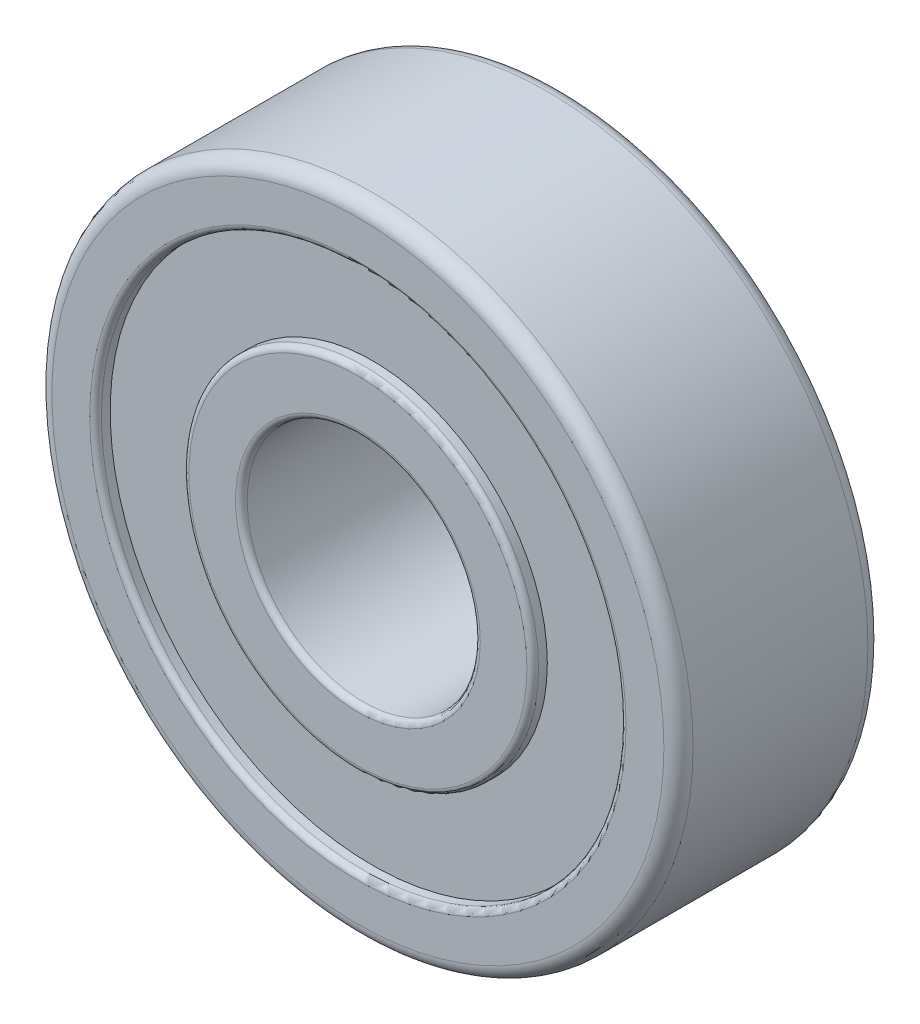
ISO-10303-21;
HEADER;
FILE_DESCRIPTION(('STEP AP214'),'2;1');
FILE_NAME('part.step','',(''),(''),'','','');
FILE_SCHEMA(('AUTOMOTIVE_DESIGN { 1 0 10303 214 1 1 1 1 }'));
ENDSEC;
DATA;
#1=APPLICATION_CONTEXT('core data for automotive mechanical design processes');
#2=APPLICATION_PROTOCOL_DEFINITION('international standard','automotive_design',2000,#1);
#3=PRODUCT_CONTEXT('',#1,'mechanical');
#4=PRODUCT('Part','Part','',(#3));
#5=PRODUCT_RELATED_PRODUCT_CATEGORY('part','',(#4));
#6=PRODUCT_DEFINITION_FORMATION('','',#4);
#7=PRODUCT_DEFINITION_CONTEXT('part definition',#1,'design');
#8=PRODUCT_DEFINITION('design','',#6,#7);
#9=PRODUCT_DEFINITION_SHAPE('','',#8);
#10=(LENGTH_UNIT() NAMED_UNIT(*) SI_UNIT(.MILLI.,.METRE.));
#11=(NAMED_UNIT(*) PLANE_ANGLE_UNIT() SI_UNIT($,.RADIAN.));
#12=(NAMED_UNIT(*) SI_UNIT($,.STERADIAN.) SOLID_ANGLE_UNIT());
#13=UNCERTAINTY_MEASURE_WITH_UNIT(LENGTH_MEASURE(1.E-05),#10,'distance_accuracy_value','');
#14=(GEOMETRIC_REPRESENTATION_CONTEXT(3) GLOBAL_UNCERTAINTY_ASSIGNED_CONTEXT((#13)) GLOBAL_UNIT_ASSIGNED_CONTEXT((#10,
#11,#12)) REPRESENTATION_CONTEXT('',''));
#15=CARTESIAN_POINT('',(0.,0.,0.));
#16=DIRECTION('',(0.,0.,1.));
#17=DIRECTION('',(1.,0.,0.));
#18=AXIS2_PLACEMENT_3D('',#15,#16,#17);
#19=CARTESIAN_POINT('',(0.,0.,7.));
#20=DIRECTION('',(0.,0.,1.));
#21=DIRECTION('',(1.,0.,0.));
#22=AXIS2_PLACEMENT_3D('',#19,#20,#21);
#23=PLANE('',#22);
#24=CARTESIAN_POINT('',(0.,0.,7.));
#25=DIRECTION('',(0.,0.,1.));
#26=DIRECTION('',(1.,0.,0.));
#27=AXIS2_PLACEMENT_3D('',#24,#25,#26);
#28=CIRCLE('',#27,4.2);
#29=CARTESIAN_POINT('',(4.2,0.,7.));
#30=VERTEX_POINT('',#29);
#31=EDGE_CURVE('E65',#30,#30,#28,.F.);
#32=ORIENTED_EDGE('',*,*,#31,.T.);
#33=EDGE_LOOP('',(#32));
#34=FACE_BOUND('',#33,.T.);
#35=CARTESIAN_POINT('',(0.,0.,7.));
#36=DIRECTION('',(0.,0.,1.));
#37=DIRECTION('',(1.,0.,0.));
#38=AXIS2_PLACEMENT_3D('',#35,#36,#37);
#39=CIRCLE('',#38,5.8);
#40=CARTESIAN_POINT('',(5.8,0.,7.));
#41=VERTEX_POINT('',#40);
#42=EDGE_CURVE('E68',#41,#41,#39,.T.);
#43=ORIENTED_EDGE('',*,*,#42,.T.);
#44=EDGE_LOOP('',(#43));
#45=FACE_BOUND('',#44,.T.);
#46=ADVANCED_FACE('F33',(#34,#45),#23,.T.);
#47=CARTESIAN_POINT('',(0.,0.,0.));
#48=DIRECTION('',(0.,0.,1.));
#49=DIRECTION('',(1.,0.,0.));
#50=AXIS2_PLACEMENT_3D('',#47,#48,#49);
#51=PLANE('',#50);
#52=CARTESIAN_POINT('',(0.,0.,0.));
#53=DIRECTION('',(0.,0.,1.));
#54=DIRECTION('',(1.,0.,0.));
#55=AXIS2_PLACEMENT_3D('',#52,#53,#54);
#56=CIRCLE('',#55,4.2);
#57=CARTESIAN_POINT('',(4.2,0.,0.));
#58=VERTEX_POINT('',#57);
#59=EDGE_CURVE('E59',#58,#58,#56,.T.);
#60=ORIENTED_EDGE('',*,*,#59,.T.);
#61=EDGE_LOOP('',(#60));
#62=FACE_BOUND('',#61,.T.);
#63=CARTESIAN_POINT('',(0.,0.,0.));
#64=DIRECTION('',(0.,0.,1.));
#65=DIRECTION('',(1.,0.,0.));
#66=AXIS2_PLACEMENT_3D('',#63,#64,#65);
#67=CIRCLE('',#66,5.8);
#68=CARTESIAN_POINT('',(5.8,0.,0.));
#69=VERTEX_POINT('',#68);
#70=EDGE_CURVE('E62',#69,#69,#67,.F.);
#71=ORIENTED_EDGE('',*,*,#70,.T.);
#72=EDGE_LOOP('',(#71));
#73=FACE_BOUND('',#72,.T.);
#74=ADVANCED_FACE('F122',(#62,#73),#51,.F.);
#75=CARTESIAN_POINT('',(0.,0.,7.));
#76=DIRECTION('',(0.,0.,1.));
#77=DIRECTION('',(1.,0.,0.));
#78=AXIS2_PLACEMENT_3D('',#75,#76,#77);
#79=CIRCLE('',#78,9.2);
#80=CARTESIAN_POINT('',(9.2,0.,7.));
#81=VERTEX_POINT('',#80);
#82=EDGE_CURVE('E48',#81,#81,#79,.F.);
#83=ORIENTED_EDGE('',*,*,#82,.T.);
#84=EDGE_LOOP('',(#83));
#85=FACE_BOUND('',#84,.T.);
#86=CARTESIAN_POINT('',(0.,0.,7.));
#87=DIRECTION('',(0.,0.,1.));
#88=DIRECTION('',(1.,0.,0.));
#89=AXIS2_PLACEMENT_3D('',#86,#87,#88);
#90=CIRCLE('',#89,10.5);
#91=CARTESIAN_POINT('',(10.5,0.,7.));
#92=VERTEX_POINT('',#91);
#93=EDGE_CURVE('E86',#92,#92,#90,.T.);
#94=ORIENTED_EDGE('',*,*,#93,.T.);
#95=EDGE_LOOP('',(#94));
#96=FACE_BOUND('',#95,.T.);
#97=ADVANCED_FACE('F125',(#85,#96),#23,.T.);
#98=CARTESIAN_POINT('',(0.,0.,0.));
#99=DIRECTION('',(0.,0.,1.));
#100=DIRECTION('',(1.,0.,0.));
#101=AXIS2_PLACEMENT_3D('',#98,#99,#100);
#102=CIRCLE('',#101,9.2);
#103=CARTESIAN_POINT('',(9.2,0.,0.));
#104=VERTEX_POINT('',#103);
#105=EDGE_CURVE('E10',#104,#104,#102,.T.);
#106=ORIENTED_EDGE('',*,*,#105,.T.);
#107=EDGE_LOOP('',(#106));
#108=FACE_BOUND('',#107,.T.);
#109=CARTESIAN_POINT('',(0.,0.,0.));
#110=DIRECTION('',(0.,0.,1.));
#111=DIRECTION('',(1.,0.,0.));
#112=AXIS2_PLACEMENT_3D('',#109,#110,#111);
#113=CIRCLE('',#112,10.5);
#114=CARTESIAN_POINT('',(10.5,0.,0.));
#115=VERTEX_POINT('',#114);
#116=EDGE_CURVE('E77',#115,#115,#113,.F.);
#117=ORIENTED_EDGE('',*,*,#116,.T.);
#118=EDGE_LOOP('',(#117));
#119=FACE_BOUND('',#118,.T.);
#120=ADVANCED_FACE('F131',(#108,#119),#51,.F.);
#121=CARTESIAN_POINT('',(0.,0.,7.));
#122=DIRECTION('',(0.,0.,-1.));
#123=DIRECTION('',(-1.,0.,0.));
#124=AXIS2_PLACEMENT_3D('',#121,#122,#123);
#125=CYLINDRICAL_SURFACE('',#124,11.);
#126=CARTESIAN_POINT('',(0.,0.,6.5));
#127=DIRECTION('',(0.,0.,1.));
#128=DIRECTION('',(1.,0.,0.));
#129=AXIS2_PLACEMENT_3D('',#126,#127,#128);
#130=CIRCLE('',#129,11.);
#131=CARTESIAN_POINT('',(11.,0.,6.5));
#132=VERTEX_POINT('',#131);
#133=EDGE_CURVE('E80',#132,#132,#130,.F.);
#134=ORIENTED_EDGE('',*,*,#133,.T.);
#135=EDGE_LOOP('',(#134));
#136=FACE_BOUND('',#135,.T.);
#137=CARTESIAN_POINT('',(0.,0.,0.5));
#138=DIRECTION('',(0.,0.,1.));
#139=DIRECTION('',(1.,0.,0.));
#140=AXIS2_PLACEMENT_3D('',#137,#138,#139);
#141=CIRCLE('',#140,11.);
#142=CARTESIAN_POINT('',(11.,0.,0.5));
#143=VERTEX_POINT('',#142);
#144=EDGE_CURVE('E83',#143,#143,#141,.T.);
#145=ORIENTED_EDGE('',*,*,#144,.T.);
#146=EDGE_LOOP('',(#145));
#147=FACE_BOUND('',#146,.T.);
#148=ADVANCED_FACE('F139',(#136,#147),#125,.T.);
#149=CARTESIAN_POINT('',(0.,0.,7.));
#150=DIRECTION('',(0.,0.,-1.));
#151=DIRECTION('',(-1.,0.,0.));
#152=AXIS2_PLACEMENT_3D('',#149,#150,#151);
#153=CYLINDRICAL_SURFACE('',#152,4.);
#154=CARTESIAN_POINT('',(0.,0.,6.8));
#155=DIRECTION('',(0.,0.,1.));
#156=DIRECTION('',(1.,0.,0.));
#157=AXIS2_PLACEMENT_3D('',#154,#155,#156);
#158=CIRCLE('',#157,4.);
#159=CARTESIAN_POINT('',(4.,0.,6.8));
#160=VERTEX_POINT('',#159);
#161=EDGE_CURVE('E71',#160,#160,#158,.T.);
#162=ORIENTED_EDGE('',*,*,#161,.T.);
#163=EDGE_LOOP('',(#162));
#164=FACE_BOUND('',#163,.T.);
#165=CARTESIAN_POINT('',(0.,0.,0.2));
#166=DIRECTION('',(0.,0.,1.));
#167=DIRECTION('',(1.,0.,0.));
#168=AXIS2_PLACEMENT_3D('',#165,#166,#167);
#169=CIRCLE('',#168,4.);
#170=CARTESIAN_POINT('',(4.,0.,0.2));
#171=VERTEX_POINT('',#170);
#172=EDGE_CURVE('E74',#171,#171,#169,.F.);
#173=ORIENTED_EDGE('',*,*,#172,.T.);
#174=EDGE_LOOP('',(#173));
#175=FACE_BOUND('',#174,.T.);
#176=ADVANCED_FACE('F196',(#164,#175),#153,.F.);
#177=CARTESIAN_POINT('',(0.,0.,0.5));
#178=DIRECTION('',(0.,0.,-1.));
#179=DIRECTION('',(-1.,0.,0.));
#180=AXIS2_PLACEMENT_3D('',#177,#178,#179);
#181=CYLINDRICAL_SURFACE('',#180,9.);
#182=CARTESIAN_POINT('',(0.,0.,0.2));
#183=DIRECTION('',(0.,0.,1.));
#184=DIRECTION('',(1.,0.,0.));
#185=AXIS2_PLACEMENT_3D('',#182,#183,#184);
#186=CIRCLE('',#185,9.);
#187=CARTESIAN_POINT('',(9.,0.,0.2));
#188=VERTEX_POINT('',#187);
#189=EDGE_CURVE('E40',#188,#188,#186,.F.);
#190=ORIENTED_EDGE('',*,*,#189,.T.);
#191=EDGE_LOOP('',(#190));
#192=FACE_BOUND('',#191,.T.);
#193=CARTESIAN_POINT('',(0.,0.,0.5));
#194=DIRECTION('',(0.,0.,-1.));
#195=DIRECTION('',(-1.,0.,0.));
#196=AXIS2_PLACEMENT_3D('',#193,#194,#195);
#197=CIRCLE('',#196,9.);
#198=CARTESIAN_POINT('',(-9.,0.,0.5));
#199=VERTEX_POINT('',#198);
#200=EDGE_CURVE('E89',#199,#199,#197,.T.);
#201=ORIENTED_EDGE('',*,*,#200,.F.);
#202=EDGE_LOOP('',(#201));
#203=FACE_BOUND('',#202,.T.);
#204=ADVANCED_FACE('F191',(#192,#203),#181,.F.);
#205=CARTESIAN_POINT('',(0.,0.,0.5));
#206=DIRECTION('',(0.,0.,-1.));
#207=DIRECTION('',(-1.,0.,0.));
#208=AXIS2_PLACEMENT_3D('',#205,#206,#207);
#209=PLANE('',#208);
#210=CARTESIAN_POINT('',(0.,0.,0.5));
#211=DIRECTION('',(0.,0.,-1.));
#212=DIRECTION('',(-1.,0.,0.));
#213=AXIS2_PLACEMENT_3D('',#210,#211,#212);
#214=CIRCLE('',#213,6.);
#215=CARTESIAN_POINT('',(-6.,0.,0.5));
#216=VERTEX_POINT('',#215);
#217=EDGE_CURVE('E92',#216,#216,#214,.T.);
#218=ORIENTED_EDGE('',*,*,#217,.F.);
#219=EDGE_LOOP('',(#218));
#220=FACE_BOUND('',#219,.T.);
#221=ORIENTED_EDGE('',*,*,#200,.T.);
#222=EDGE_LOOP('',(#221));
#223=FACE_BOUND('',#222,.T.);
#224=ADVANCED_FACE('F118',(#220,#223),#209,.T.);
#225=CARTESIAN_POINT('',(0.,0.,0.5));
#226=DIRECTION('',(0.,0.,-1.));
#227=DIRECTION('',(-1.,0.,0.));
#228=AXIS2_PLACEMENT_3D('',#225,#226,#227);
#229=CYLINDRICAL_SURFACE('',#228,6.);
#230=CARTESIAN_POINT('',(0.,0.,0.2));
#231=DIRECTION('',(0.,0.,1.));
#232=DIRECTION('',(1.,0.,0.));
#233=AXIS2_PLACEMENT_3D('',#230,#231,#232);
#234=CIRCLE('',#233,6.);
#235=CARTESIAN_POINT('',(6.,0.,0.2));
#236=VERTEX_POINT('',#235);
#237=EDGE_CURVE('E44',#236,#236,#234,.T.);
#238=ORIENTED_EDGE('',*,*,#237,.T.);
#239=EDGE_LOOP('',(#238));
#240=FACE_BOUND('',#239,.T.);
#241=ORIENTED_EDGE('',*,*,#217,.T.);
#242=EDGE_LOOP('',(#241));
#243=FACE_BOUND('',#242,.T.);
#244=ADVANCED_FACE('F112',(#240,#243),#229,.T.);
#245=CARTESIAN_POINT('',(0.,0.,6.5));
#246=DIRECTION('',(0.,0.,1.));
#247=DIRECTION('',(1.,0.,0.));
#248=AXIS2_PLACEMENT_3D('',#245,#246,#247);
#249=CYLINDRICAL_SURFACE('',#248,9.);
#250=CARTESIAN_POINT('',(0.,0.,6.8));
#251=DIRECTION('',(0.,0.,1.));
#252=DIRECTION('',(1.,0.,0.));
#253=AXIS2_PLACEMENT_3D('',#250,#251,#252);
#254=CIRCLE('',#253,9.);
#255=CARTESIAN_POINT('',(9.,0.,6.8));
#256=VERTEX_POINT('',#255);
#257=EDGE_CURVE('E53',#256,#256,#254,.T.);
#258=ORIENTED_EDGE('',*,*,#257,.T.);
#259=EDGE_LOOP('',(#258));
#260=FACE_BOUND('',#259,.T.);
#261=CARTESIAN_POINT('',(0.,0.,6.5));
#262=DIRECTION('',(0.,0.,1.));
#263=DIRECTION('',(1.,0.,0.));
#264=AXIS2_PLACEMENT_3D('',#261,#262,#263);
#265=CIRCLE('',#264,9.);
#266=CARTESIAN_POINT('',(9.,0.,6.5));
#267=VERTEX_POINT('',#266);
#268=EDGE_CURVE('E95',#267,#267,#265,.T.);
#269=ORIENTED_EDGE('',*,*,#268,.F.);
#270=EDGE_LOOP('',(#269));
#271=FACE_BOUND('',#270,.T.);
#272=ADVANCED_FACE('F107',(#260,#271),#249,.F.);
#273=CARTESIAN_POINT('',(0.,0.,6.5));
#274=DIRECTION('',(0.,0.,1.));
#275=DIRECTION('',(1.,0.,0.));
#276=AXIS2_PLACEMENT_3D('',#273,#274,#275);
#277=PLANE('',#276);
#278=CARTESIAN_POINT('',(0.,0.,6.5));
#279=DIRECTION('',(0.,0.,1.));
#280=DIRECTION('',(1.,0.,0.));
#281=AXIS2_PLACEMENT_3D('',#278,#279,#280);
#282=CIRCLE('',#281,6.);
#283=CARTESIAN_POINT('',(6.,0.,6.5));
#284=VERTEX_POINT('',#283);
#285=EDGE_CURVE('E98',#284,#284,#282,.T.);
#286=ORIENTED_EDGE('',*,*,#285,.F.);
#287=EDGE_LOOP('',(#286));
#288=FACE_BOUND('',#287,.T.);
#289=ORIENTED_EDGE('',*,*,#268,.T.);
#290=EDGE_LOOP('',(#289));
#291=FACE_BOUND('',#290,.T.);
#292=ADVANCED_FACE('F104',(#288,#291),#277,.T.);
#293=CARTESIAN_POINT('',(0.,0.,6.5));
#294=DIRECTION('',(0.,0.,1.));
#295=DIRECTION('',(1.,0.,0.));
#296=AXIS2_PLACEMENT_3D('',#293,#294,#295);
#297=CYLINDRICAL_SURFACE('',#296,6.);
#298=CARTESIAN_POINT('',(0.,0.,6.8));
#299=DIRECTION('',(0.,0.,1.));
#300=DIRECTION('',(1.,0.,0.));
#301=AXIS2_PLACEMENT_3D('',#298,#299,#300);
#302=CIRCLE('',#301,6.);
#303=CARTESIAN_POINT('',(6.,0.,6.8));
#304=VERTEX_POINT('',#303);
#305=EDGE_CURVE('E56',#304,#304,#302,.F.);
#306=ORIENTED_EDGE('',*,*,#305,.T.);
#307=EDGE_LOOP('',(#306));
#308=FACE_BOUND('',#307,.T.);
#309=ORIENTED_EDGE('',*,*,#285,.T.);
#310=EDGE_LOOP('',(#309));
#311=FACE_BOUND('',#310,.T.);
#312=ADVANCED_FACE('F102',(#308,#311),#297,.T.);
#313=CARTESIAN_POINT('',(0.,0.,6.5));
#314=DIRECTION('',(0.,0.,1.));
#315=DIRECTION('',(1.,0.,0.));
#316=AXIS2_PLACEMENT_3D('',#313,#314,#315);
#317=TOROIDAL_SURFACE('',#316,10.5,0.5);
#318=ORIENTED_EDGE('',*,*,#133,.F.);
#319=EDGE_LOOP('',(#318));
#320=FACE_BOUND('',#319,.T.);
#321=ORIENTED_EDGE('',*,*,#93,.F.);
#322=EDGE_LOOP('',(#321));
#323=FACE_BOUND('',#322,.T.);
#324=ADVANCED_FACE('F144',(#320,#323),#317,.T.);
#325=CARTESIAN_POINT('',(0.,0.,0.5));
#326=DIRECTION('',(0.,0.,1.));
#327=DIRECTION('',(1.,0.,0.));
#328=AXIS2_PLACEMENT_3D('',#325,#326,#327);
#329=TOROIDAL_SURFACE('',#328,10.5,0.5);
#330=ORIENTED_EDGE('',*,*,#116,.F.);
#331=EDGE_LOOP('',(#330));
#332=FACE_BOUND('',#331,.T.);
#333=ORIENTED_EDGE('',*,*,#144,.F.);
#334=EDGE_LOOP('',(#333));
#335=FACE_BOUND('',#334,.T.);
#336=ADVANCED_FACE('F146',(#332,#335),#329,.T.);
#337=CARTESIAN_POINT('',(0.,0.,6.8));
#338=DIRECTION('',(0.,0.,1.));
#339=DIRECTION('',(1.,0.,0.));
#340=AXIS2_PLACEMENT_3D('',#337,#338,#339);
#341=TOROIDAL_SURFACE('',#340,4.2,0.2);
#342=ORIENTED_EDGE('',*,*,#31,.F.);
#343=EDGE_LOOP('',(#342));
#344=FACE_BOUND('',#343,.T.);
#345=ORIENTED_EDGE('',*,*,#161,.F.);
#346=EDGE_LOOP('',(#345));
#347=FACE_BOUND('',#346,.T.);
#348=ADVANCED_FACE('F153',(#344,#347),#341,.T.);
#349=CARTESIAN_POINT('',(0.,0.,0.2));
#350=DIRECTION('',(0.,0.,1.));
#351=DIRECTION('',(1.,0.,0.));
#352=AXIS2_PLACEMENT_3D('',#349,#350,#351);
#353=TOROIDAL_SURFACE('',#352,4.2,0.2);
#354=ORIENTED_EDGE('',*,*,#172,.F.);
#355=EDGE_LOOP('',(#354));
#356=FACE_BOUND('',#355,.T.);
#357=ORIENTED_EDGE('',*,*,#59,.F.);
#358=EDGE_LOOP('',(#357));
#359=FACE_BOUND('',#358,.T.);
#360=ADVANCED_FACE('F163',(#356,#359),#353,.T.);
#361=CARTESIAN_POINT('',(0.,0.,6.8));
#362=DIRECTION('',(0.,0.,1.));
#363=DIRECTION('',(1.,0.,0.));
#364=AXIS2_PLACEMENT_3D('',#361,#362,#363);
#365=TOROIDAL_SURFACE('',#364,5.8,0.2);
#366=ORIENTED_EDGE('',*,*,#305,.F.);
#367=EDGE_LOOP('',(#366));
#368=FACE_BOUND('',#367,.T.);
#369=ORIENTED_EDGE('',*,*,#42,.F.);
#370=EDGE_LOOP('',(#369));
#371=FACE_BOUND('',#370,.T.);
#372=ADVANCED_FACE('F167',(#368,#371),#365,.T.);
#373=CARTESIAN_POINT('',(0.,0.,6.8));
#374=DIRECTION('',(0.,0.,1.));
#375=DIRECTION('',(1.,0.,0.));
#376=AXIS2_PLACEMENT_3D('',#373,#374,#375);
#377=TOROIDAL_SURFACE('',#376,9.2,0.2);
#378=ORIENTED_EDGE('',*,*,#82,.F.);
#379=EDGE_LOOP('',(#378));
#380=FACE_BOUND('',#379,.T.);
#381=ORIENTED_EDGE('',*,*,#257,.F.);
#382=EDGE_LOOP('',(#381));
#383=FACE_BOUND('',#382,.T.);
#384=ADVANCED_FACE('F171',(#380,#383),#377,.T.);
#385=CARTESIAN_POINT('',(0.,0.,0.2));
#386=DIRECTION('',(0.,0.,1.));
#387=DIRECTION('',(1.,0.,0.));
#388=AXIS2_PLACEMENT_3D('',#385,#386,#387);
#389=TOROIDAL_SURFACE('',#388,5.8,0.2);
#390=ORIENTED_EDGE('',*,*,#237,.F.);
#391=EDGE_LOOP('',(#390));
#392=FACE_BOUND('',#391,.T.);
#393=ORIENTED_EDGE('',*,*,#70,.F.);
#394=EDGE_LOOP('',(#393));
#395=FACE_BOUND('',#394,.T.);
#396=ADVANCED_FACE('F174',(#392,#395),#389,.T.);
#397=CARTESIAN_POINT('',(0.,0.,0.2));
#398=DIRECTION('',(0.,0.,1.));
#399=DIRECTION('',(1.,0.,0.));
#400=AXIS2_PLACEMENT_3D('',#397,#398,#399);
#401=TOROIDAL_SURFACE('',#400,9.2,0.2);
#402=ORIENTED_EDGE('',*,*,#105,.F.);
#403=EDGE_LOOP('',(#402));
#404=FACE_BOUND('',#403,.T.);
#405=ORIENTED_EDGE('',*,*,#189,.F.);
#406=EDGE_LOOP('',(#405));
#407=FACE_BOUND('',#406,.T.);
#408=ADVANCED_FACE('F35',(#404,#407),#401,.T.);
#409=CLOSED_SHELL('',(#46,#74,#97,#120,#148,#176,#204,#224,#244,#272,#292,#312,#324,#336,#348,
#360,#372,#384,#396,#408));
#410=MANIFOLD_SOLID_BREP('B2',#409);
#411=ADVANCED_BREP_SHAPE_REPRESENTATION('',(#18,#410),#14);
#412=SHAPE_DEFINITION_REPRESENTATION(#9,#411);
ENDSEC;
END-ISO-10303-21;
